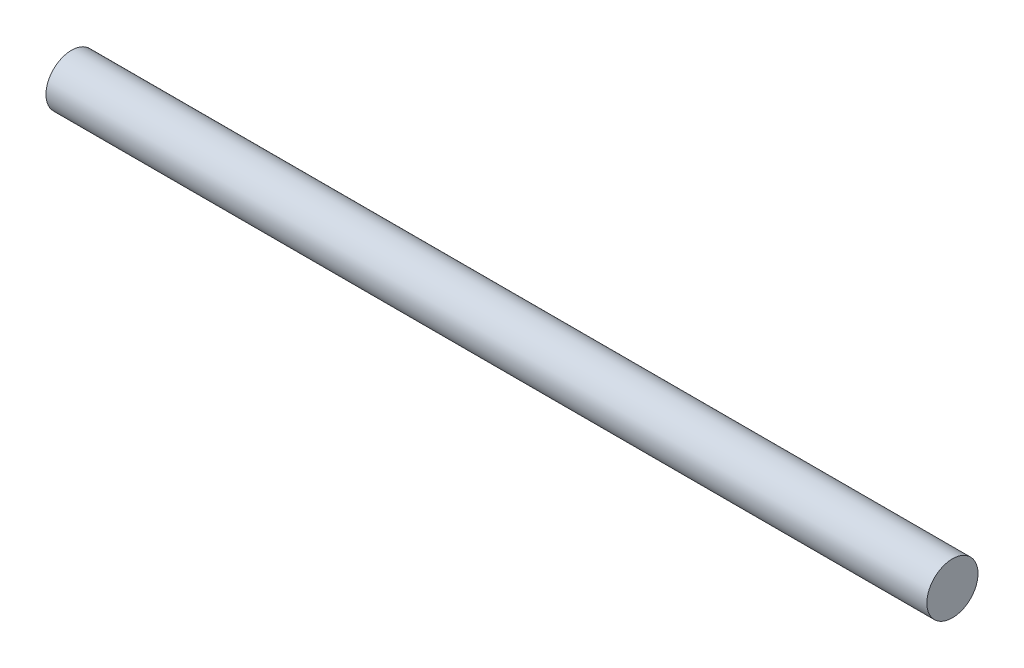
ISO-10303-21;
HEADER;
FILE_DESCRIPTION(('STEP AP214'),'2;1');
FILE_NAME('part.step','',(''),(''),'','','');
FILE_SCHEMA(('AUTOMOTIVE_DESIGN { 1 0 10303 214 1 1 1 1 }'));
ENDSEC;
DATA;
#1=APPLICATION_CONTEXT('core data for automotive mechanical design processes');
#2=APPLICATION_PROTOCOL_DEFINITION('international standard','automotive_design',2000,#1);
#3=PRODUCT_CONTEXT('',#1,'mechanical');
#4=PRODUCT('Part','Part','',(#3));
#5=PRODUCT_RELATED_PRODUCT_CATEGORY('part','',(#4));
#6=PRODUCT_DEFINITION_FORMATION('','',#4);
#7=PRODUCT_DEFINITION_CONTEXT('part definition',#1,'design');
#8=PRODUCT_DEFINITION('design','',#6,#7);
#9=PRODUCT_DEFINITION_SHAPE('','',#8);
#10=(LENGTH_UNIT() NAMED_UNIT(*) SI_UNIT(.MILLI.,.METRE.));
#11=(NAMED_UNIT(*) PLANE_ANGLE_UNIT() SI_UNIT($,.RADIAN.));
#12=(NAMED_UNIT(*) SI_UNIT($,.STERADIAN.) SOLID_ANGLE_UNIT());
#13=UNCERTAINTY_MEASURE_WITH_UNIT(LENGTH_MEASURE(1.E-05),#10,'distance_accuracy_value','');
#14=(GEOMETRIC_REPRESENTATION_CONTEXT(3) GLOBAL_UNCERTAINTY_ASSIGNED_CONTEXT((#13)) GLOBAL_UNIT_ASSIGNED_CONTEXT((#10,
#11,#12)) REPRESENTATION_CONTEXT('',''));
#15=CARTESIAN_POINT('',(0.,0.,0.));
#16=DIRECTION('',(0.,0.,1.));
#17=DIRECTION('',(1.,0.,0.));
#18=AXIS2_PLACEMENT_3D('',#15,#16,#17);
#19=CARTESIAN_POINT('',(620.,0.,0.));
#20=DIRECTION('',(-1.,0.,0.));
#21=DIRECTION('',(0.,0.,1.));
#22=AXIS2_PLACEMENT_3D('',#19,#20,#21);
#23=CYLINDRICAL_SURFACE('',#22,18.);
#24=CARTESIAN_POINT('',(620.,0.,0.));
#25=DIRECTION('',(1.,0.,0.));
#26=DIRECTION('',(0.,0.,-1.));
#27=AXIS2_PLACEMENT_3D('',#24,#25,#26);
#28=CIRCLE('',#27,18.);
#29=CARTESIAN_POINT('',(620.,0.,-18.));
#30=VERTEX_POINT('',#29);
#31=EDGE_CURVE('E12',#30,#30,#28,.T.);
#32=ORIENTED_EDGE('',*,*,#31,.F.);
#33=EDGE_LOOP('',(#32));
#34=FACE_BOUND('',#33,.T.);
#35=CARTESIAN_POINT('',(0.,0.,0.));
#36=DIRECTION('',(1.,0.,0.));
#37=DIRECTION('',(0.,0.,-1.));
#38=AXIS2_PLACEMENT_3D('',#35,#36,#37);
#39=CIRCLE('',#38,18.);
#40=CARTESIAN_POINT('',(0.,0.,-18.));
#41=VERTEX_POINT('',#40);
#42=EDGE_CURVE('E50',#41,#41,#39,.T.);
#43=ORIENTED_EDGE('',*,*,#42,.T.);
#44=EDGE_LOOP('',(#43));
#45=FACE_BOUND('',#44,.T.);
#46=ADVANCED_FACE('F47',(#34,#45),#23,.T.);
#47=CARTESIAN_POINT('',(620.,0.,0.));
#48=DIRECTION('',(1.,0.,0.));
#49=DIRECTION('',(0.,0.,-1.));
#50=AXIS2_PLACEMENT_3D('',#47,#48,#49);
#51=PLANE('',#50);
#52=ORIENTED_EDGE('',*,*,#31,.T.);
#53=EDGE_LOOP('',(#52));
#54=FACE_BOUND('',#53,.T.);
#55=ADVANCED_FACE('F62',(#54),#51,.T.);
#56=CARTESIAN_POINT('',(0.,0.,0.));
#57=DIRECTION('',(1.,0.,0.));
#58=DIRECTION('',(0.,0.,-1.));
#59=AXIS2_PLACEMENT_3D('',#56,#57,#58);
#60=PLANE('',#59);
#61=ORIENTED_EDGE('',*,*,#42,.F.);
#62=EDGE_LOOP('',(#61));
#63=FACE_BOUND('',#62,.T.);
#64=ADVANCED_FACE('F60',(#63),#60,.F.);
#65=CLOSED_SHELL('',(#46,#55,#64));
#66=MANIFOLD_SOLID_BREP('B2',#65);
#67=ADVANCED_BREP_SHAPE_REPRESENTATION('',(#18,#66),#14);
#68=SHAPE_DEFINITION_REPRESENTATION(#9,#67);
ENDSEC;
END-ISO-10303-21;
